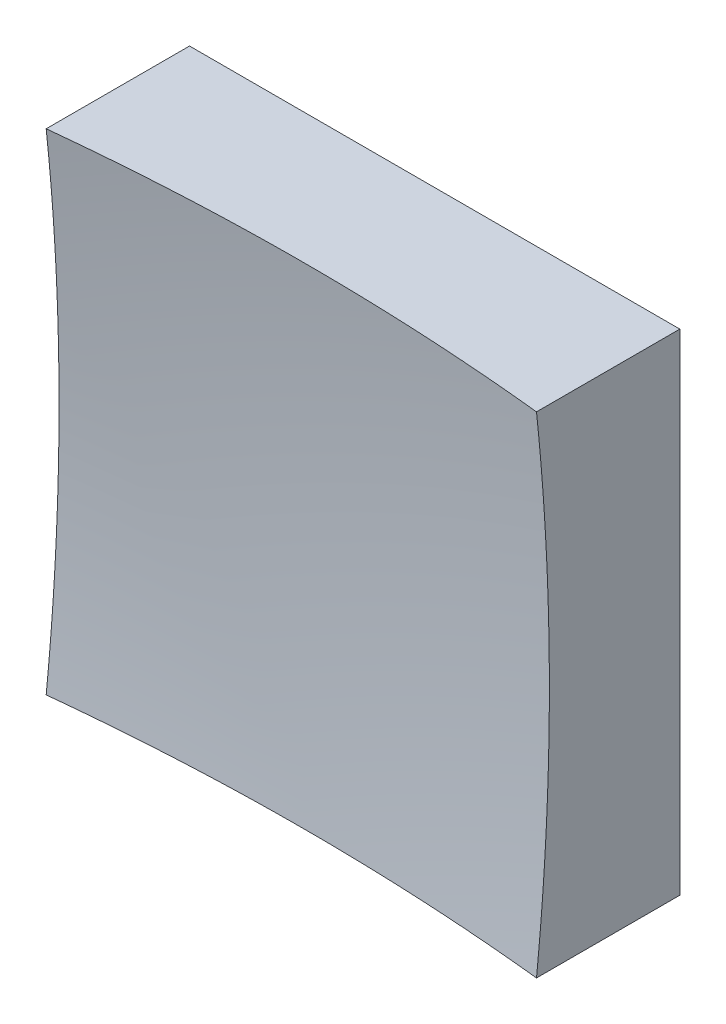
ISO-10303-21;
HEADER;
FILE_DESCRIPTION(('STEP AP214'),'2;1');
FILE_NAME('part.step','',(''),(''),'','','');
FILE_SCHEMA(('AUTOMOTIVE_DESIGN { 1 0 10303 214 1 1 1 1 }'));
ENDSEC;
DATA;
#1=APPLICATION_CONTEXT('core data for automotive mechanical design processes');
#2=APPLICATION_PROTOCOL_DEFINITION('international standard','automotive_design',2000,#1);
#3=PRODUCT_CONTEXT('',#1,'mechanical');
#4=PRODUCT('Part','Part','',(#3));
#5=PRODUCT_RELATED_PRODUCT_CATEGORY('part','',(#4));
#6=PRODUCT_DEFINITION_FORMATION('','',#4);
#7=PRODUCT_DEFINITION_CONTEXT('part definition',#1,'design');
#8=PRODUCT_DEFINITION('design','',#6,#7);
#9=PRODUCT_DEFINITION_SHAPE('','',#8);
#10=(LENGTH_UNIT() NAMED_UNIT(*) SI_UNIT(.MILLI.,.METRE.));
#11=(NAMED_UNIT(*) PLANE_ANGLE_UNIT() SI_UNIT($,.RADIAN.));
#12=(NAMED_UNIT(*) SI_UNIT($,.STERADIAN.) SOLID_ANGLE_UNIT());
#13=UNCERTAINTY_MEASURE_WITH_UNIT(LENGTH_MEASURE(1.E-05),#10,'distance_accuracy_value','');
#14=(GEOMETRIC_REPRESENTATION_CONTEXT(3) GLOBAL_UNCERTAINTY_ASSIGNED_CONTEXT((#13)) GLOBAL_UNIT_ASSIGNED_CONTEXT((#10,
#11,#12)) REPRESENTATION_CONTEXT('',''));
#15=CARTESIAN_POINT('',(0.,0.,0.));
#16=DIRECTION('',(0.,0.,1.));
#17=DIRECTION('',(1.,0.,0.));
#18=AXIS2_PLACEMENT_3D('',#15,#16,#17);
#19=CARTESIAN_POINT('',(-6.25,6.25,10.));
#20=DIRECTION('',(0.,1.,0.));
#21=DIRECTION('',(0.,0.,1.));
#22=AXIS2_PLACEMENT_3D('',#19,#20,#21);
#23=PLANE('',#22);
#24=CARTESIAN_POINT('',(0.,6.25,63.));
#25=DIRECTION('',(0.,1.,0.));
#26=DIRECTION('',(0.,0.,1.));
#27=AXIS2_PLACEMENT_3D('',#24,#25,#26);
#28=CIRCLE('',#27,59.6735913114001);
#29=CARTESIAN_POINT('',(6.25,6.25,3.65461264765391));
#30=VERTEX_POINT('',#29);
#31=CARTESIAN_POINT('',(-6.25,6.25,3.65461264765391));
#32=VERTEX_POINT('',#31);
#33=EDGE_CURVE('E79',#30,#32,#28,.T.);
#34=ORIENTED_EDGE('',*,*,#33,.F.);
#35=DIRECTION('',(0.,0.,-1.));
#36=VECTOR('',#35,1.);
#37=CARTESIAN_POINT('',(6.25,6.25,10.));
#38=LINE('',#37,#36);
#39=CARTESIAN_POINT('',(6.25,6.25,0.));
#40=VERTEX_POINT('',#39);
#41=EDGE_CURVE('E85',#30,#40,#38,.T.);
#42=ORIENTED_EDGE('',*,*,#41,.T.);
#43=DIRECTION('',(1.,0.,0.));
#44=VECTOR('',#43,1.);
#45=CARTESIAN_POINT('',(-6.25,6.25,0.));
#46=LINE('',#45,#44);
#47=CARTESIAN_POINT('',(-6.25,6.25,0.));
#48=VERTEX_POINT('',#47);
#49=EDGE_CURVE('E88',#48,#40,#46,.T.);
#50=ORIENTED_EDGE('',*,*,#49,.F.);
#51=DIRECTION('',(0.,0.,-1.));
#52=VECTOR('',#51,1.);
#53=CARTESIAN_POINT('',(-6.25,6.25,10.));
#54=LINE('',#53,#52);
#55=EDGE_CURVE('E47',#32,#48,#54,.T.);
#56=ORIENTED_EDGE('',*,*,#55,.F.);
#57=EDGE_LOOP('',(#34,#42,#50,#56));
#58=FACE_BOUND('',#57,.T.);
#59=ADVANCED_FACE('F39',(#58),#23,.T.);
#60=CARTESIAN_POINT('',(-6.25,6.25,10.));
#61=DIRECTION('',(1.,0.,0.));
#62=DIRECTION('',(0.,0.,-1.));
#63=AXIS2_PLACEMENT_3D('',#60,#61,#62);
#64=PLANE('',#63);
#65=DIRECTION('',(0.,0.,-1.));
#66=VECTOR('',#65,1.);
#67=CARTESIAN_POINT('',(-6.25,-6.25,10.));
#68=LINE('',#67,#66);
#69=CARTESIAN_POINT('',(-6.25,-6.25,3.65461264765391));
#70=VERTEX_POINT('',#69);
#71=CARTESIAN_POINT('',(-6.25,-6.25,0.));
#72=VERTEX_POINT('',#71);
#73=EDGE_CURVE('E100',#70,#72,#68,.T.);
#74=ORIENTED_EDGE('',*,*,#73,.F.);
#75=CARTESIAN_POINT('',(-6.25,0.,63.));
#76=DIRECTION('',(1.,0.,0.));
#77=DIRECTION('',(0.,0.,-1.));
#78=AXIS2_PLACEMENT_3D('',#75,#76,#77);
#79=CIRCLE('',#78,59.6735913114001);
#80=EDGE_CURVE('E89',#70,#32,#79,.T.);
#81=ORIENTED_EDGE('',*,*,#80,.T.);
#82=ORIENTED_EDGE('',*,*,#55,.T.);
#83=DIRECTION('',(0.,-1.,0.));
#84=VECTOR('',#83,1.);
#85=CARTESIAN_POINT('',(-6.25,6.25,0.));
#86=LINE('',#85,#84);
#87=EDGE_CURVE('E97',#48,#72,#86,.T.);
#88=ORIENTED_EDGE('',*,*,#87,.T.);
#89=EDGE_LOOP('',(#74,#81,#82,#88));
#90=FACE_BOUND('',#89,.T.);
#91=ADVANCED_FACE('F122',(#90),#64,.F.);
#92=CARTESIAN_POINT('',(-6.25,-6.25,10.));
#93=DIRECTION('',(0.,1.,0.));
#94=DIRECTION('',(0.,0.,1.));
#95=AXIS2_PLACEMENT_3D('',#92,#93,#94);
#96=PLANE('',#95);
#97=DIRECTION('',(0.,0.,-1.));
#98=VECTOR('',#97,1.);
#99=CARTESIAN_POINT('',(6.25,-6.25,10.));
#100=LINE('',#99,#98);
#101=CARTESIAN_POINT('',(6.25,-6.25,3.65461264765391));
#102=VERTEX_POINT('',#101);
#103=CARTESIAN_POINT('',(6.25,-6.25,0.));
#104=VERTEX_POINT('',#103);
#105=EDGE_CURVE('E96',#102,#104,#100,.T.);
#106=ORIENTED_EDGE('',*,*,#105,.F.);
#107=CARTESIAN_POINT('',(0.,-6.25,63.));
#108=DIRECTION('',(0.,1.,0.));
#109=DIRECTION('',(0.,0.,1.));
#110=AXIS2_PLACEMENT_3D('',#107,#108,#109);
#111=CIRCLE('',#110,59.6735913114001);
#112=EDGE_CURVE('E53',#102,#70,#111,.T.);
#113=ORIENTED_EDGE('',*,*,#112,.T.);
#114=ORIENTED_EDGE('',*,*,#73,.T.);
#115=DIRECTION('',(1.,0.,0.));
#116=VECTOR('',#115,1.);
#117=CARTESIAN_POINT('',(-6.25,-6.25,0.));
#118=LINE('',#117,#116);
#119=EDGE_CURVE('E102',#72,#104,#118,.T.);
#120=ORIENTED_EDGE('',*,*,#119,.T.);
#121=EDGE_LOOP('',(#106,#113,#114,#120));
#122=FACE_BOUND('',#121,.T.);
#123=ADVANCED_FACE('F121',(#122),#96,.F.);
#124=CARTESIAN_POINT('',(6.25,6.25,10.));
#125=DIRECTION('',(1.,0.,0.));
#126=DIRECTION('',(0.,0.,-1.));
#127=AXIS2_PLACEMENT_3D('',#124,#125,#126);
#128=PLANE('',#127);
#129=CARTESIAN_POINT('',(6.25,0.,63.));
#130=DIRECTION('',(1.,0.,0.));
#131=DIRECTION('',(0.,0.,-1.));
#132=AXIS2_PLACEMENT_3D('',#129,#130,#131);
#133=CIRCLE('',#132,59.6735913114001);
#134=EDGE_CURVE('E11',#102,#30,#133,.T.);
#135=ORIENTED_EDGE('',*,*,#134,.F.);
#136=ORIENTED_EDGE('',*,*,#105,.T.);
#137=DIRECTION('',(0.,-1.,0.));
#138=VECTOR('',#137,1.);
#139=CARTESIAN_POINT('',(6.25,6.25,0.));
#140=LINE('',#139,#138);
#141=EDGE_CURVE('E93',#40,#104,#140,.T.);
#142=ORIENTED_EDGE('',*,*,#141,.F.);
#143=ORIENTED_EDGE('',*,*,#41,.F.);
#144=EDGE_LOOP('',(#135,#136,#142,#143));
#145=FACE_BOUND('',#144,.T.);
#146=ADVANCED_FACE('F91',(#145),#128,.T.);
#147=CARTESIAN_POINT('',(0.,0.,0.));
#148=DIRECTION('',(0.,0.,-1.));
#149=DIRECTION('',(-1.,0.,0.));
#150=AXIS2_PLACEMENT_3D('',#147,#148,#149);
#151=PLANE('',#150);
#152=ORIENTED_EDGE('',*,*,#49,.T.);
#153=ORIENTED_EDGE('',*,*,#141,.T.);
#154=ORIENTED_EDGE('',*,*,#119,.F.);
#155=ORIENTED_EDGE('',*,*,#87,.F.);
#156=EDGE_LOOP('',(#152,#153,#154,#155));
#157=FACE_BOUND('',#156,.T.);
#158=ADVANCED_FACE('F125',(#157),#151,.T.);
#159=CARTESIAN_POINT('',(0.,0.,63.));
#160=DIRECTION('',(0.,0.,1.));
#161=DIRECTION('',(1.,0.,0.));
#162=AXIS2_PLACEMENT_3D('',#159,#160,#161);
#163=SPHERICAL_SURFACE('',#162,60.);
#164=ORIENTED_EDGE('',*,*,#33,.T.);
#165=ORIENTED_EDGE('',*,*,#80,.F.);
#166=ORIENTED_EDGE('',*,*,#112,.F.);
#167=ORIENTED_EDGE('',*,*,#134,.T.);
#168=EDGE_LOOP('',(#164,#165,#166,#167));
#169=FACE_BOUND('',#168,.T.);
#170=ADVANCED_FACE('F78',(#169),#163,.F.);
#171=CLOSED_SHELL('',(#59,#91,#123,#146,#158,#170));
#172=MANIFOLD_SOLID_BREP('B2',#171);
#173=ADVANCED_BREP_SHAPE_REPRESENTATION('',(#18,#172),#14);
#174=SHAPE_DEFINITION_REPRESENTATION(#9,#173);
ENDSEC;
END-ISO-10303-21;
